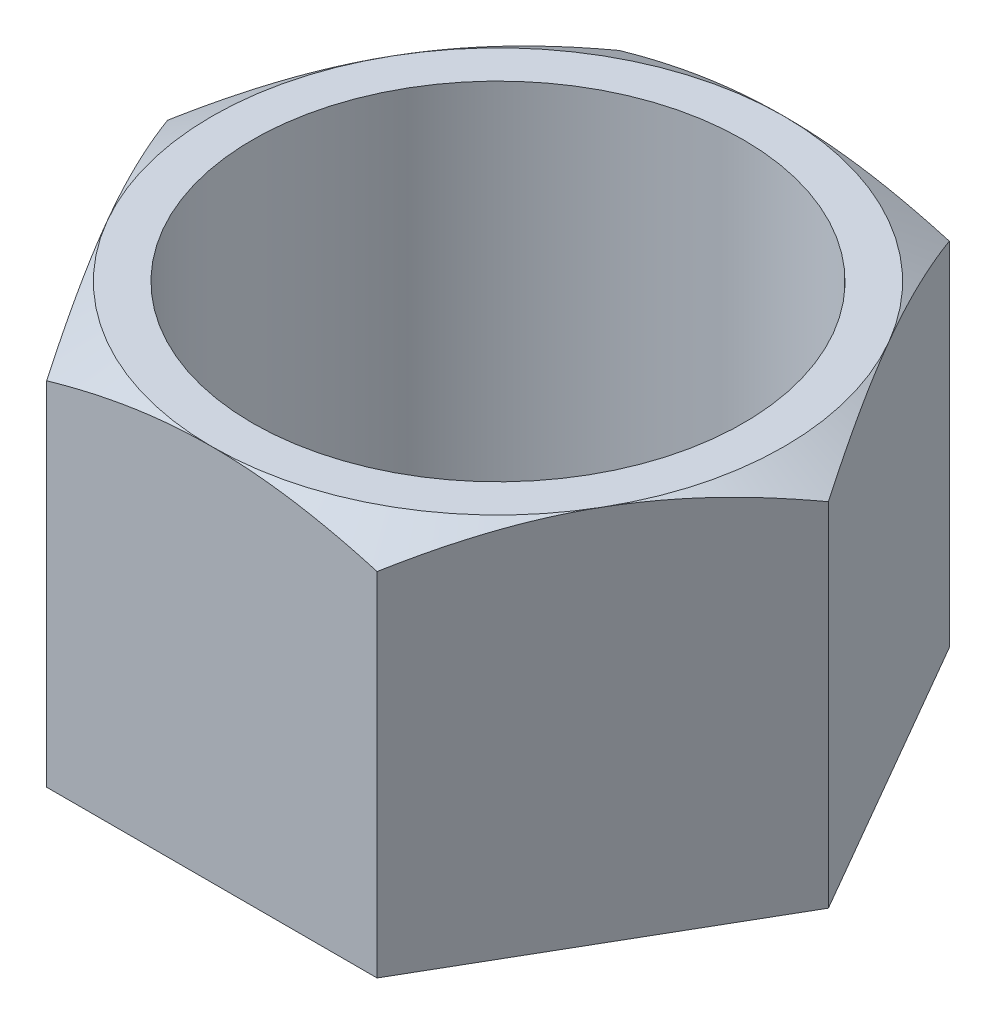
ISO-10303-21;
HEADER;
FILE_DESCRIPTION(('STEP AP214'),'2;1');
FILE_NAME('part.step','',(''),(''),'','','');
FILE_SCHEMA(('AUTOMOTIVE_DESIGN { 1 0 10303 214 1 1 1 1 }'));
ENDSEC;
DATA;
#1=APPLICATION_CONTEXT('core data for automotive mechanical design processes');
#2=APPLICATION_PROTOCOL_DEFINITION('international standard','automotive_design',2000,#1);
#3=PRODUCT_CONTEXT('',#1,'mechanical');
#4=PRODUCT('Part','Part','',(#3));
#5=PRODUCT_RELATED_PRODUCT_CATEGORY('part','',(#4));
#6=PRODUCT_DEFINITION_FORMATION('','',#4);
#7=PRODUCT_DEFINITION_CONTEXT('part definition',#1,'design');
#8=PRODUCT_DEFINITION('design','',#6,#7);
#9=PRODUCT_DEFINITION_SHAPE('','',#8);
#10=(LENGTH_UNIT() NAMED_UNIT(*) SI_UNIT(.MILLI.,.METRE.));
#11=(NAMED_UNIT(*) PLANE_ANGLE_UNIT() SI_UNIT($,.RADIAN.));
#12=(NAMED_UNIT(*) SI_UNIT($,.STERADIAN.) SOLID_ANGLE_UNIT());
#13=UNCERTAINTY_MEASURE_WITH_UNIT(LENGTH_MEASURE(1.E-05),#10,'distance_accuracy_value','');
#14=(GEOMETRIC_REPRESENTATION_CONTEXT(3) GLOBAL_UNCERTAINTY_ASSIGNED_CONTEXT((#13)) GLOBAL_UNIT_ASSIGNED_CONTEXT((#10,
#11,#12)) REPRESENTATION_CONTEXT('',''));
#15=CARTESIAN_POINT('',(0.,0.,0.));
#16=DIRECTION('',(0.,0.,1.));
#17=DIRECTION('',(1.,0.,0.));
#18=AXIS2_PLACEMENT_3D('',#15,#16,#17);
#19=CARTESIAN_POINT('',(8.75000000000018,20.,15.1554445662276));
#20=DIRECTION('',(-0.866025403784442,0.,-0.499999999999995));
#21=DIRECTION('',(-0.499999999999995,0.,0.866025403784442));
#22=AXIS2_PLACEMENT_3D('',#19,#20,#21);
#23=PLANE('',#22);
#24=CARTESIAN_POINT('',(8.74988452994634,18.6463036218551,15.1556445662276));
#25=CARTESIAN_POINT('',(8.94220608067119,18.7573332286213,14.8225338689817));
#26=CARTESIAN_POINT('',(9.13527778877703,18.8633245189489,14.4881238610383));
#27=CARTESIAN_POINT('',(9.52296941282811,19.0638299878254,13.8166222705129));
#28=CARTESIAN_POINT('',(9.71758981567844,19.1583403915805,13.4795298445866));
#29=CARTESIAN_POINT('',(10.1087549544331,19.3346136721167,12.8020119501137));
#30=CARTESIAN_POINT('',(10.3053031132929,19.4163463880283,12.4615805528344));
#31=CARTESIAN_POINT('',(10.6997652023538,19.5653092521169,11.7783521729212));
#32=CARTESIAN_POINT('',(10.8976790539741,19.6325402276478,11.4355553263932));
#33=CARTESIAN_POINT('',(11.2898012238542,19.7496400474975,10.7563798053868));
#34=CARTESIAN_POINT('',(11.4839804306472,19.7998964716164,10.4200515534478));
#35=CARTESIAN_POINT('',(11.8732286098864,19.884165362966,9.7458539302518));
#36=CARTESIAN_POINT('',(12.068297599386,19.9181775175294,9.40798452945743));
#37=CARTESIAN_POINT('',(12.4587632660955,19.9690990825114,8.73167815610525));
#38=CARTESIAN_POINT('',(12.6541592762256,19.9860288162489,8.3932423389638));
#39=CARTESIAN_POINT('',(13.0451316644246,20.0024214534515,7.71605829824646));
#40=CARTESIAN_POINT('',(13.2407080367337,20.0018848966266,7.3773100846471));
#41=CARTESIAN_POINT('',(13.6063365275202,19.9845650118537,6.74402296191016));
#42=CARTESIAN_POINT('',(13.7764147024639,19.9698942931565,6.44943892164917));
#43=CARTESIAN_POINT('',(14.1161798326727,19.927620397212,5.86094845348723));
#44=CARTESIAN_POINT('',(14.2858667594127,19.9000163052202,5.56704207499337));
#45=CARTESIAN_POINT('',(14.6247572252735,19.8323569553841,4.98006656992168));
#46=CARTESIAN_POINT('',(14.7939602482537,19.792291414023,4.68699833732578));
#47=CARTESIAN_POINT('',(15.1315730403667,19.7004121035848,4.10223582810077));
#48=CARTESIAN_POINT('',(15.2999827547779,19.6485975358418,3.81054164625241));
#49=CARTESIAN_POINT('',(15.811199777951,19.4742204932458,2.92508778842243));
#50=CARTESIAN_POINT('',(16.152526690289,19.3342708523476,2.33389223426252));
#51=CARTESIAN_POINT('',(16.8300909318384,19.0166424667218,1.16031654250711));
#52=CARTESIAN_POINT('',(17.1663369360539,18.8390383174895,0.577921379363705));
#53=CARTESIAN_POINT('',(17.5001154700538,18.6463036218551,-0.000200000000000166));
#54=B_SPLINE_CURVE_WITH_KNOTS('',3,(#24,#25,#26,#27,#28,#29,#30,#31,#32,#33,#34,#35,#36,#37,#38,
#39,#40,#41,#42,#43,#44,#45,#46,#47,#48,#49,#50,#51,#52,#53),.UNSPECIFIED.,.F.,.F.,(4,2,2,2,2,2,
2,2,2,2,2,2,2,2,4),(0.,1.20107305768067,2.40253995270546,3.60680134987754,4.81099402327995,
5.98546439607889,7.15995737398961,8.33305137922413,9.50610913577562,10.527280668868,
11.5485244377133,12.5706132099581,13.5927714817648,15.6820380431479,17.7672037024678),.UNSPECIFIED.);
#55=CARTESIAN_POINT('',(8.75000000000018,18.6463702891816,15.1554445662276));
#56=VERTEX_POINT('',#55);
#57=CARTESIAN_POINT('',(13.1250000000001,20.,7.57772228311379));
#58=VERTEX_POINT('',#57);
#59=EDGE_CURVE('E115',#56,#58,#54,.T.);
#60=ORIENTED_EDGE('',*,*,#59,.F.);
#61=DIRECTION('',(0.,-1.,0.));
#62=VECTOR('',#61,1.);
#63=CARTESIAN_POINT('',(8.75000000000018,20.,15.1554445662276));
#64=LINE('',#63,#62);
#65=CARTESIAN_POINT('',(8.75000000000018,0.,15.1554445662276));
#66=VERTEX_POINT('',#65);
#67=EDGE_CURVE('E64',#56,#66,#64,.T.);
#68=ORIENTED_EDGE('',*,*,#67,.T.);
#69=DIRECTION('',(0.499999999999995,0.,-0.866025403784442));
#70=VECTOR('',#69,1.);
#71=CARTESIAN_POINT('',(8.75000000000018,0.,15.1554445662276));
#72=LINE('',#71,#70);
#73=CARTESIAN_POINT('',(17.5,0.,0.));
#74=VERTEX_POINT('',#73);
#75=EDGE_CURVE('E122',#66,#74,#72,.T.);
#76=ORIENTED_EDGE('',*,*,#75,.T.);
#77=DIRECTION('',(0.,-1.,0.));
#78=VECTOR('',#77,1.);
#79=CARTESIAN_POINT('',(17.5,20.,0.));
#80=LINE('',#79,#78);
#81=CARTESIAN_POINT('',(17.5,18.6463702891816,0.));
#82=VERTEX_POINT('',#81);
#83=EDGE_CURVE('E136',#82,#74,#80,.T.);
#84=ORIENTED_EDGE('',*,*,#83,.F.);
#85=EDGE_CURVE('E123',#58,#82,#54,.T.);
#86=ORIENTED_EDGE('',*,*,#85,.F.);
#87=EDGE_LOOP('',(#60,#68,#76,#84,#86));
#88=FACE_BOUND('',#87,.T.);
#89=ADVANCED_FACE('F41',(#88),#23,.F.);
#90=CARTESIAN_POINT('',(17.5,20.,0.));
#91=DIRECTION('',(-0.866025403784438,0.,0.500000000000001));
#92=DIRECTION('',(0.500000000000001,0.,0.866025403784438));
#93=AXIS2_PLACEMENT_3D('',#90,#91,#92);
#94=PLANE('',#93);
#95=CARTESIAN_POINT('',(17.5001154700538,18.6463036218551,0.000200000000000298));
#96=CARTESIAN_POINT('',(17.307793919329,18.7573332286213,-0.332910697245878));
#97=CARTESIAN_POINT('',(17.1147222112231,18.8633245189489,-0.667320705189298));
#98=CARTESIAN_POINT('',(16.7270305871721,19.0638299878254,-1.33882229571467));
#99=CARTESIAN_POINT('',(16.5324101843217,19.1583403915805,-1.67591472164096));
#100=CARTESIAN_POINT('',(16.141245045567,19.3346136721167,-2.35343261611384));
#101=CARTESIAN_POINT('',(15.9446968867072,19.4163463880284,-2.69386401339313));
#102=CARTESIAN_POINT('',(15.5502347976464,19.5653092521169,-3.37709239330631));
#103=CARTESIAN_POINT('',(15.3523209460261,19.6325402276478,-3.71988923983432));
#104=CARTESIAN_POINT('',(14.960198776146,19.7496400474975,-4.39906476084074));
#105=CARTESIAN_POINT('',(14.7660195693529,19.7998964716164,-4.73539301277978));
#106=CARTESIAN_POINT('',(14.3767713901137,19.884165362966,-5.40959063597575));
#107=CARTESIAN_POINT('',(14.1817024006142,19.9181775175295,-5.74746003677012));
#108=CARTESIAN_POINT('',(13.7912367339046,19.9690990825115,-6.4237664101223));
#109=CARTESIAN_POINT('',(13.5958407237746,19.9860288162489,-6.76220222726374));
#110=CARTESIAN_POINT('',(13.2048683355755,20.0024214534515,-7.43938626798108));
#111=CARTESIAN_POINT('',(13.0092919632664,20.0018848966267,-7.77813448158044));
#112=CARTESIAN_POINT('',(12.6436634724799,19.9845650118538,-8.41142160431738));
#113=CARTESIAN_POINT('',(12.4735852975363,19.9698942931566,-8.70600564457838));
#114=CARTESIAN_POINT('',(12.1338201673274,19.927620397212,-9.29449611274033));
#115=CARTESIAN_POINT('',(11.9641332405874,19.9000163052203,-9.5884024912342));
#116=CARTESIAN_POINT('',(11.6252427747266,19.8323569553841,-10.1753779963059));
#117=CARTESIAN_POINT('',(11.4560397517464,19.7922914140231,-10.4684462289018));
#118=CARTESIAN_POINT('',(11.1184269596333,19.7004121035848,-11.0532087381268));
#119=CARTESIAN_POINT('',(10.9500172452221,19.6485975358418,-11.3449029199752));
#120=CARTESIAN_POINT('',(10.438800222049,19.4742204932458,-12.2303567778052));
#121=CARTESIAN_POINT('',(10.097473309711,19.3342708523477,-12.8215523319651));
#122=CARTESIAN_POINT('',(9.41990906816164,19.0166424667218,-13.9951280237206));
#123=CARTESIAN_POINT('',(9.08366306394605,18.8390383174895,-14.577523186864));
#124=CARTESIAN_POINT('',(8.74988452994613,18.6463036218551,-15.1556445662277));
#125=B_SPLINE_CURVE_WITH_KNOTS('',3,(#95,#96,#97,#98,#99,#100,#101,#102,#103,#104,#105,#106,
#107,#108,#109,#110,#111,#112,#113,#114,#115,#116,#117,#118,#119,#120,#121,#122,#123,#124),
.UNSPECIFIED.,.F.,.F.,(4,2,2,2,2,2,2,2,2,2,2,2,2,2,4),(0.,1.20107305768067,2.40253995270546,
3.60680134987754,4.81099402327995,5.98546439607889,7.15995737398961,8.33305137922413,
9.50610913577562,10.527280668868,11.5485244377134,12.5706132099582,13.5927714817649,
15.6820380431481,17.767203702468),.UNSPECIFIED.);
#126=CARTESIAN_POINT('',(13.125,20.,-7.57772228311388));
#127=VERTEX_POINT('',#126);
#128=EDGE_CURVE('E128',#82,#127,#125,.T.);
#129=ORIENTED_EDGE('',*,*,#128,.F.);
#130=ORIENTED_EDGE('',*,*,#83,.T.);
#131=DIRECTION('',(-0.500000000000001,0.,-0.866025403784438));
#132=VECTOR('',#131,1.);
#133=CARTESIAN_POINT('',(17.5,0.,0.));
#134=LINE('',#133,#132);
#135=CARTESIAN_POINT('',(8.74999999999997,0.,-15.1554445662277));
#136=VERTEX_POINT('',#135);
#137=EDGE_CURVE('E259',#74,#136,#134,.T.);
#138=ORIENTED_EDGE('',*,*,#137,.T.);
#139=DIRECTION('',(0.,-1.,0.));
#140=VECTOR('',#139,1.);
#141=CARTESIAN_POINT('',(8.74999999999997,20.,-15.1554445662277));
#142=LINE('',#141,#140);
#143=CARTESIAN_POINT('',(8.74999999999997,18.6463702891816,-15.1554445662277));
#144=VERTEX_POINT('',#143);
#145=EDGE_CURVE('E207',#144,#136,#142,.T.);
#146=ORIENTED_EDGE('',*,*,#145,.F.);
#147=EDGE_CURVE('E137',#127,#144,#125,.T.);
#148=ORIENTED_EDGE('',*,*,#147,.F.);
#149=EDGE_LOOP('',(#129,#130,#138,#146,#148));
#150=FACE_BOUND('',#149,.T.);
#151=ADVANCED_FACE('F195',(#150),#94,.F.);
#152=CARTESIAN_POINT('',(8.74999999999997,20.,-15.1554445662277));
#153=DIRECTION('',(0.,0.,1.));
#154=DIRECTION('',(1.,0.,0.));
#155=AXIS2_PLACEMENT_3D('',#152,#153,#154);
#156=PLANE('',#155);
#157=CARTESIAN_POINT('',(33.4754355047652,7.53450030257999,-15.1554445662278));
#158=CARTESIAN_POINT('',(32.7085164534544,7.93782189366615,-15.1554445662278));
#159=CARTESIAN_POINT('',(31.9406572896009,8.33936885702415,-15.1554445662278));
#160=CARTESIAN_POINT('',(30.4025919359014,9.13800952363892,-15.1554445662278));
#161=CARTESIAN_POINT('',(29.6323856610771,9.53510306316187,-15.1554445662278));
#162=CARTESIAN_POINT('',(28.0881872828031,10.3244287253741,-15.1554445662278));
#163=CARTESIAN_POINT('',(27.3141915022601,10.7166536650912,-15.1554445662278));
#164=CARTESIAN_POINT('',(25.7628610719403,11.4944268749106,-15.1554445662278));
#165=CARTESIAN_POINT('',(24.9855264658287,11.8799752319994,-15.1554445662278));
#166=CARTESIAN_POINT('',(23.3819645476763,12.6646832913896,-15.1554445662278));
#167=CARTESIAN_POINT('',(22.5554958456296,13.0633510193118,-15.1554445662277));
#168=CARTESIAN_POINT('',(20.8968604608328,13.8487577567814,-15.1554445662277));
#169=CARTESIAN_POINT('',(20.0646935733522,14.2354963349486,-15.1554445662277));
#170=CARTESIAN_POINT('',(18.3936628844106,14.9932274176335,-15.1554445662277));
#171=CARTESIAN_POINT('',(17.5548025421458,15.364227499657,-15.1554445662277));
#172=CARTESIAN_POINT('',(16.2898916539533,15.9051786950646,-15.1554445662277));
#173=CARTESIAN_POINT('',(15.8671622754374,16.0828998923224,-15.1554445662277));
#174=CARTESIAN_POINT('',(15.019222508146,16.4323129696105,-15.1554445662277));
#175=CARTESIAN_POINT('',(14.5940121628569,16.6040049549525,-15.1554445662277));
#176=CARTESIAN_POINT('',(13.6978122220743,16.9573489028654,-15.1554445662277));
#177=CARTESIAN_POINT('',(13.2265293957891,17.1382597700732,-15.1554445662277));
#178=CARTESIAN_POINT('',(12.2802392890441,17.4900310040304,-15.1554445662277));
#179=CARTESIAN_POINT('',(11.8052321480463,17.6608917451028,-15.1554445662277));
#180=CARTESIAN_POINT('',(10.8509440856924,17.9907496474135,-15.1554445662277));
#181=CARTESIAN_POINT('',(10.3716620865205,18.1497437163009,-15.1554445662277));
#182=CARTESIAN_POINT('',(9.40867280572553,18.4535926867794,-15.1554445662277));
#183=CARTESIAN_POINT('',(8.92496552324996,18.5984475856467,-15.1554445662277));
#184=CARTESIAN_POINT('',(7.48716586653893,19.0022831661275,-15.1554445662277));
#185=CARTESIAN_POINT('',(6.52610906980685,19.2377484999723,-15.1554445662277));
#186=CARTESIAN_POINT('',(5.07204533995559,19.5267270407932,-15.1554445662277));
#187=CARTESIAN_POINT('',(4.58534073977665,19.6123431301753,-15.1554445662277));
#188=CARTESIAN_POINT('',(3.60825639768221,19.7595476280251,-15.1554445662277));
#189=CARTESIAN_POINT('',(3.11787670535746,19.8211363601189,-15.1554445662277));
#190=CARTESIAN_POINT('',(2.12428194090053,19.9190763740208,-15.1554445662277));
#191=CARTESIAN_POINT('',(1.6210119255986,19.9548765314852,-15.1554445662277));
#192=CARTESIAN_POINT('',(0.613238559986097,19.9976462022484,-15.1554445662277));
#193=CARTESIAN_POINT('',(0.108735227753677,20.0046161356399,-15.1554445662277));
#194=CARTESIAN_POINT('',(-0.899805773503052,19.9894249494338,-15.1554445662277));
#195=CARTESIAN_POINT('',(-1.40384346098623,19.9672650389502,-15.1554445662277));
#196=CARTESIAN_POINT('',(-2.4098748394523,19.8947603298869,-15.1554445662277));
#197=CARTESIAN_POINT('',(-2.91186847131162,19.8444147217978,-15.1554445662277));
#198=CARTESIAN_POINT('',(-3.9235743042002,19.7161208086671,-15.1554445662277));
#199=CARTESIAN_POINT('',(-4.4332113370169,19.6375860752743,-15.1554445662277));
#200=CARTESIAN_POINT('',(-5.4481070707292,19.4559797830248,-15.1554445662277));
#201=CARTESIAN_POINT('',(-5.95336525300239,19.3529053578081,-15.1554445662276));
#202=CARTESIAN_POINT('',(-6.95927382659931,19.1252979532279,-15.1554445662276));
#203=CARTESIAN_POINT('',(-7.45992153005125,19.0007531997553,-15.1554445662276));
#204=CARTESIAN_POINT('',(-8.45625570245552,18.7333274971175,-15.1554445662276));
#205=CARTESIAN_POINT('',(-8.95194218424121,18.5904465953963,-15.1554445662276));
#206=CARTESIAN_POINT('',(-9.99019305341515,18.273399453593,-15.1554445662276));
#207=CARTESIAN_POINT('',(-10.5322328988061,18.0975239383735,-15.1554445662276));
#208=CARTESIAN_POINT('',(-11.6110011855649,17.7301218154631,-15.1554445662276));
#209=CARTESIAN_POINT('',(-12.1477291500434,17.5385938165622,-15.1554445662276));
#210=CARTESIAN_POINT('',(-13.2165931490162,17.1425627590696,-15.1554445662276));
#211=CARTESIAN_POINT('',(-13.7487273185249,16.938054688546,-15.1554445662276));
#212=CARTESIAN_POINT('',(-14.8087428824185,16.5183799610651,-15.1554445662276));
#213=CARTESIAN_POINT('',(-15.336624398692,16.3032136108656,-15.1554445662276));
#214=CARTESIAN_POINT('',(-16.3896296323411,15.8636381803235,-15.1554445662276));
#215=CARTESIAN_POINT('',(-16.9147466837913,15.6392131755685,-15.1554445662276));
#216=CARTESIAN_POINT('',(-17.9617490928508,15.1829560926661,-15.1554445662276));
#217=CARTESIAN_POINT('',(-18.4836344329743,14.9511239744831,-15.1554445662276));
#218=CARTESIAN_POINT('',(-19.5244843588656,14.4812963051241,-15.1554445662276));
#219=CARTESIAN_POINT('',(-20.0434495451039,14.2433020819825,-15.1554445662276));
#220=CARTESIAN_POINT('',(-21.0789338043124,13.7620633080001,-15.1554445662276));
#221=CARTESIAN_POINT('',(-21.5954528843639,13.5188187723696,-15.1554445662276));
#222=CARTESIAN_POINT('',(-23.0712473228751,12.8160298299479,-15.1554445662276));
#223=CARTESIAN_POINT('',(-24.027906863294,12.3509919099315,-15.1554445662276));
#224=CARTESIAN_POINT('',(-25.9355526521193,11.40933170952,-15.1554445662276));
#225=CARTESIAN_POINT('',(-26.8865385675975,10.9327087574826,-15.1554445662276));
#226=CARTESIAN_POINT('',(-28.7792370969611,9.97299034403316,-15.1554445662276));
#227=CARTESIAN_POINT('',(-29.7209722978866,9.489939373715,-15.1554445662276));
#228=CARTESIAN_POINT('',(-31.1308417613524,8.76022208834859,-15.1554445662276));
#229=CARTESIAN_POINT('',(-31.6003169157204,8.51613977052755,-15.1554445662276));
#230=CARTESIAN_POINT('',(-32.5384594847679,8.02643258339529,-15.1554445662276));
#231=CARTESIAN_POINT('',(-33.0071269030326,7.7808077209535,-15.1554445662276));
#232=CARTESIAN_POINT('',(-33.4754355047653,7.53450030257999,-15.1554445662276));
#233=B_SPLINE_CURVE_WITH_KNOTS('',3,(#157,#158,#159,#160,#161,#162,#163,#164,#165,#166,#167,
#168,#169,#170,#171,#172,#173,#174,#175,#176,#177,#178,#179,#180,#181,#182,#183,#184,#185,#186,
#187,#188,#189,#190,#191,#192,#193,#194,#195,#196,#197,#198,#199,#200,#201,#202,#203,#204,#205,
#206,#207,#208,#209,#210,#211,#212,#213,#214,#215,#216,#217,#218,#219,#220,#221,#222,#223,#224,
#225,#226,#227,#228,#229,#230,#231,#232),.UNSPECIFIED.,.F.,.F.,(4,2,2,2,2,2,2,2,2,2,2,2,2,2,2,2,
2,2,2,2,2,2,2,2,2,2,2,2,2,2,2,2,2,2,2,2,2,4),(0.,2.59952552549204,5.1991463134323,
7.80223112784135,10.4052820021831,13.1580004630053,15.9108183508064,18.6622954567994,
20.0379631033629,21.4136067093108,22.9279464680161,24.4422297884726,25.9569063500141,
27.4715832033393,30.4364416810586,31.9184917490478,33.4005218545075,34.9133536422533,
36.4261633860548,37.9389103385268,39.4517007401953,40.9979833096202,42.5444465813396,
44.0917606313234,45.6390706777807,47.3483541479036,49.0577897065801,50.7678893848166,
52.4779398729261,54.1910653496653,55.9042000874395,57.6169686403318,59.3297322318828,
62.5207141807863,65.7118815702586,68.8870326989313,70.4744334475427,72.0618271319707),.UNSPECIFIED.);
#234=CARTESIAN_POINT('',(0.,20.,-15.1554445662277));
#235=VERTEX_POINT('',#234);
#236=EDGE_CURVE('E189',#144,#235,#233,.T.);
#237=ORIENTED_EDGE('',*,*,#236,.F.);
#238=ORIENTED_EDGE('',*,*,#145,.T.);
#239=DIRECTION('',(-1.,0.,0.));
#240=VECTOR('',#239,1.);
#241=CARTESIAN_POINT('',(8.74999999999997,0.,-15.1554445662277));
#242=LINE('',#241,#240);
#243=CARTESIAN_POINT('',(-8.75000000000007,0.,-15.1554445662276));
#244=VERTEX_POINT('',#243);
#245=EDGE_CURVE('E225',#136,#244,#242,.T.);
#246=ORIENTED_EDGE('',*,*,#245,.T.);
#247=DIRECTION('',(0.,-1.,0.));
#248=VECTOR('',#247,1.);
#249=CARTESIAN_POINT('',(-8.75000000000007,20.,-15.1554445662276));
#250=LINE('',#249,#248);
#251=CARTESIAN_POINT('',(-8.75000000000007,18.6463702891816,-15.1554445662276));
#252=VERTEX_POINT('',#251);
#253=EDGE_CURVE('E223',#252,#244,#250,.T.);
#254=ORIENTED_EDGE('',*,*,#253,.F.);
#255=EDGE_CURVE('E183',#235,#252,#233,.T.);
#256=ORIENTED_EDGE('',*,*,#255,.F.);
#257=EDGE_LOOP('',(#237,#238,#246,#254,#256));
#258=FACE_BOUND('',#257,.T.);
#259=ADVANCED_FACE('F191',(#258),#156,.F.);
#260=CARTESIAN_POINT('',(-8.75000000000007,20.,-15.1554445662276));
#261=DIRECTION('',(0.866025403784442,0.,0.499999999999995));
#262=DIRECTION('',(0.499999999999995,0.,-0.866025403784442));
#263=AXIS2_PLACEMENT_3D('',#260,#261,#262);
#264=PLANE('',#263);
#265=CARTESIAN_POINT('',(-8.74988452994623,18.6463036218551,-15.1556445662276));
#266=CARTESIAN_POINT('',(-8.94220608067108,18.7573332286213,-14.8225338689818));
#267=CARTESIAN_POINT('',(-9.13527778877692,18.8633245189489,-14.4881238610383));
#268=CARTESIAN_POINT('',(-9.522969412828,19.0638299878254,-13.816622270513));
#269=CARTESIAN_POINT('',(-9.71758981567833,19.1583403915805,-13.4795298445867));
#270=CARTESIAN_POINT('',(-10.108754954433,19.3346136721167,-12.8020119501138));
#271=CARTESIAN_POINT('',(-10.3053031132928,19.4163463880284,-12.4615805528345));
#272=CARTESIAN_POINT('',(-10.6997652023537,19.5653092521169,-11.7783521729213));
#273=CARTESIAN_POINT('',(-10.897679053974,19.6325402276478,-11.4355553263933));
#274=CARTESIAN_POINT('',(-11.289801223854,19.7496400474975,-10.7563798053869));
#275=CARTESIAN_POINT('',(-11.4839804306471,19.7998964716164,-10.4200515534478));
#276=CARTESIAN_POINT('',(-11.8732286098863,19.884165362966,-9.74585393025186));
#277=CARTESIAN_POINT('',(-12.0682975993859,19.9181775175295,-9.4079845294575));
#278=CARTESIAN_POINT('',(-12.4587632660954,19.9690990825115,-8.73167815610531));
#279=CARTESIAN_POINT('',(-12.6541592762254,19.9860288162489,-8.39324233896387));
#280=CARTESIAN_POINT('',(-13.0451316644245,20.0024214534515,-7.71605829824653));
#281=CARTESIAN_POINT('',(-13.2407080367336,20.0018848966267,-7.37731008464717));
#282=CARTESIAN_POINT('',(-13.6063365275201,19.9845650118538,-6.74402296191022));
#283=CARTESIAN_POINT('',(-13.7764147024638,19.9698942931566,-6.44943892164922));
#284=CARTESIAN_POINT('',(-14.1161798326726,19.927620397212,-5.86094845348727));
#285=CARTESIAN_POINT('',(-14.2858667594126,19.9000163052203,-5.5670420749934));
#286=CARTESIAN_POINT('',(-14.6247572252734,19.8323569553841,-4.9800665699217));
#287=CARTESIAN_POINT('',(-14.7939602482536,19.7922914140231,-4.68699833732578));
#288=CARTESIAN_POINT('',(-15.1315730403667,19.7004121035848,-4.10223582810076));
#289=CARTESIAN_POINT('',(-15.2999827547779,19.6485975358419,-3.81054164625239));
#290=CARTESIAN_POINT('',(-15.811199777951,19.4742204932458,-2.92508778842239));
#291=CARTESIAN_POINT('',(-16.1525266902889,19.3342708523477,-2.33389223426247));
#292=CARTESIAN_POINT('',(-16.8300909318383,19.0166424667218,-1.16031654250702));
#293=CARTESIAN_POINT('',(-17.1663369360539,18.8390383174895,-0.577921379363599));
#294=CARTESIAN_POINT('',(-17.5001154700538,18.6463036218551,0.000200000000120672));
#295=B_SPLINE_CURVE_WITH_KNOTS('',3,(#265,#266,#267,#268,#269,#270,#271,#272,#273,#274,#275,
#276,#277,#278,#279,#280,#281,#282,#283,#284,#285,#286,#287,#288,#289,#290,#291,#292,#293,#294),
.UNSPECIFIED.,.F.,.F.,(4,2,2,2,2,2,2,2,2,2,2,2,2,2,4),(0.,1.20107305768066,2.40253995270546,
3.60680134987754,4.81099402327995,5.98546439607889,7.15995737398961,8.33305137922412,
9.50610913577561,10.527280668868,11.5485244377134,12.5706132099582,13.5927714817649,
15.6820380431481,17.767203702468),.UNSPECIFIED.);
#296=CARTESIAN_POINT('',(-13.1250000000001,20.,-7.57772228311379));
#297=VERTEX_POINT('',#296);
#298=EDGE_CURVE('E190',#252,#297,#295,.T.);
#299=ORIENTED_EDGE('',*,*,#298,.F.);
#300=ORIENTED_EDGE('',*,*,#253,.T.);
#301=DIRECTION('',(-0.499999999999995,0.,0.866025403784442));
#302=VECTOR('',#301,1.);
#303=CARTESIAN_POINT('',(-8.75000000000007,0.,-15.1554445662276));
#304=LINE('',#303,#302);
#305=CARTESIAN_POINT('',(-17.5,0.,1.2220184685951E-13));
#306=VERTEX_POINT('',#305);
#307=EDGE_CURVE('E257',#244,#306,#304,.T.);
#308=ORIENTED_EDGE('',*,*,#307,.T.);
#309=DIRECTION('',(0.,-1.,0.));
#310=VECTOR('',#309,1.);
#311=CARTESIAN_POINT('',(-17.5,20.,1.2220184685951E-13));
#312=LINE('',#311,#310);
#313=CARTESIAN_POINT('',(-17.5,18.6463702891816,1.22597411139621E-13));
#314=VERTEX_POINT('',#313);
#315=EDGE_CURVE('E229',#314,#306,#312,.T.);
#316=ORIENTED_EDGE('',*,*,#315,.F.);
#317=EDGE_CURVE('E177',#297,#314,#295,.T.);
#318=ORIENTED_EDGE('',*,*,#317,.F.);
#319=EDGE_LOOP('',(#299,#300,#308,#316,#318));
#320=FACE_BOUND('',#319,.T.);
#321=ADVANCED_FACE('F194',(#320),#264,.F.);
#322=CARTESIAN_POINT('',(-17.5,20.,1.2220184685951E-13));
#323=DIRECTION('',(0.866025403784435,0.,-0.500000000000007));
#324=DIRECTION('',(-0.500000000000007,0.,-0.866025403784435));
#325=AXIS2_PLACEMENT_3D('',#322,#323,#324);
#326=PLANE('',#325);
#327=CARTESIAN_POINT('',(-17.5001154700538,18.6463036218551,-0.000199999999877798));
#328=CARTESIAN_POINT('',(-17.307793919329,18.7573332286213,0.332910697246));
#329=CARTESIAN_POINT('',(-17.1147222112231,18.8633245189489,0.667320705189418));
#330=CARTESIAN_POINT('',(-16.727030587172,19.0638299878254,1.33882229571479));
#331=CARTESIAN_POINT('',(-16.5324101843217,19.1583403915805,1.67591472164108));
#332=CARTESIAN_POINT('',(-16.141245045567,19.3346136721167,2.35343261611395));
#333=CARTESIAN_POINT('',(-15.9446968867072,19.4163463880284,2.69386401339324));
#334=CARTESIAN_POINT('',(-15.5502347976463,19.5653092521169,3.37709239330642));
#335=CARTESIAN_POINT('',(-15.352320946026,19.6325402276478,3.71988923983443));
#336=CARTESIAN_POINT('',(-14.960198776146,19.7496400474975,4.39906476084084));
#337=CARTESIAN_POINT('',(-14.7660195693529,19.7998964716164,4.73539301277989));
#338=CARTESIAN_POINT('',(-14.3767713901137,19.884165362966,5.40959063597586));
#339=CARTESIAN_POINT('',(-14.1817024006141,19.9181775175295,5.74746003677022));
#340=CARTESIAN_POINT('',(-13.7912367339046,19.9690990825115,6.4237664101224));
#341=CARTESIAN_POINT('',(-13.5958407237745,19.9860288162489,6.76220222726384));
#342=CARTESIAN_POINT('',(-13.2048683355755,20.0024214534515,7.43938626798117));
#343=CARTESIAN_POINT('',(-13.0092919632664,20.0018848966267,7.77813448158053));
#344=CARTESIAN_POINT('',(-12.6436634724799,19.9845650118538,8.41142160431747));
#345=CARTESIAN_POINT('',(-12.4735852975362,19.9698942931566,8.70600564457847));
#346=CARTESIAN_POINT('',(-12.1338201673274,19.927620397212,9.29449611274042));
#347=CARTESIAN_POINT('',(-11.9641332405874,19.9000163052203,9.58840249123429));
#348=CARTESIAN_POINT('',(-11.6252427747265,19.8323569553841,10.175377996306));
#349=CARTESIAN_POINT('',(-11.4560397517463,19.7922914140231,10.4684462289019));
#350=CARTESIAN_POINT('',(-11.1184269596333,19.7004121035848,11.0532087381269));
#351=CARTESIAN_POINT('',(-10.950017245222,19.6485975358418,11.3449029199753));
#352=CARTESIAN_POINT('',(-10.4388002220489,19.4742204932458,12.2303567778053));
#353=CARTESIAN_POINT('',(-10.097473309711,19.3342708523477,12.8215523319652));
#354=CARTESIAN_POINT('',(-9.41990906816154,19.0166424667218,13.9951280237206));
#355=CARTESIAN_POINT('',(-9.08366306394595,18.8390383174895,14.577523186864));
#356=CARTESIAN_POINT('',(-8.74988452994602,18.6463036218551,15.1556445662278));
#357=B_SPLINE_CURVE_WITH_KNOTS('',3,(#327,#328,#329,#330,#331,#332,#333,#334,#335,#336,#337,
#338,#339,#340,#341,#342,#343,#344,#345,#346,#347,#348,#349,#350,#351,#352,#353,#354,#355,#356),
.UNSPECIFIED.,.F.,.F.,(4,2,2,2,2,2,2,2,2,2,2,2,2,2,4),(0.,1.20107305768067,2.40253995270546,
3.60680134987754,4.81099402327995,5.98546439607889,7.15995737398961,8.33305137922413,
9.50610913577562,10.527280668868,11.5485244377134,12.5706132099582,13.5927714817649,
15.6820380431481,17.767203702468),.UNSPECIFIED.);
#358=CARTESIAN_POINT('',(-13.125,20.,7.57772228311397));
#359=VERTEX_POINT('',#358);
#360=EDGE_CURVE('E241',#314,#359,#357,.T.);
#361=ORIENTED_EDGE('',*,*,#360,.F.);
#362=ORIENTED_EDGE('',*,*,#315,.T.);
#363=DIRECTION('',(0.500000000000007,0.,0.866025403784435));
#364=VECTOR('',#363,1.);
#365=CARTESIAN_POINT('',(-17.5,0.,1.2220184685951E-13));
#366=LINE('',#365,#364);
#367=CARTESIAN_POINT('',(-8.74999999999986,0.,15.1554445662278));
#368=VERTEX_POINT('',#367);
#369=EDGE_CURVE('E253',#306,#368,#366,.T.);
#370=ORIENTED_EDGE('',*,*,#369,.T.);
#371=DIRECTION('',(0.,-1.,0.));
#372=VECTOR('',#371,1.);
#373=CARTESIAN_POINT('',(-8.74999999999986,20.,15.1554445662278));
#374=LINE('',#373,#372);
#375=CARTESIAN_POINT('',(-8.74999999999986,18.6463702891816,15.1554445662278));
#376=VERTEX_POINT('',#375);
#377=EDGE_CURVE('E232',#376,#368,#374,.T.);
#378=ORIENTED_EDGE('',*,*,#377,.F.);
#379=EDGE_CURVE('E170',#359,#376,#357,.T.);
#380=ORIENTED_EDGE('',*,*,#379,.F.);
#381=EDGE_LOOP('',(#361,#362,#370,#378,#380));
#382=FACE_BOUND('',#381,.T.);
#383=ADVANCED_FACE('F240',(#382),#326,.F.);
#384=CARTESIAN_POINT('',(-8.74999999999986,20.,15.1554445662278));
#385=DIRECTION('',(0.,0.,-1.));
#386=DIRECTION('',(-1.,0.,0.));
#387=AXIS2_PLACEMENT_3D('',#384,#385,#386);
#388=PLANE('',#387);
#389=CARTESIAN_POINT('',(-33.4754355047651,7.53450030257999,15.155444566228));
#390=CARTESIAN_POINT('',(-32.7085164534543,7.93782189366616,15.155444566228));
#391=CARTESIAN_POINT('',(-31.9406572896008,8.33936885702415,15.155444566228));
#392=CARTESIAN_POINT('',(-30.4025919359013,9.13800952363892,15.155444566228));
#393=CARTESIAN_POINT('',(-29.632385661077,9.53510306316188,15.155444566228));
#394=CARTESIAN_POINT('',(-28.088187282803,10.3244287253741,15.155444566228));
#395=CARTESIAN_POINT('',(-27.31419150226,10.7166536650912,15.155444566228));
#396=CARTESIAN_POINT('',(-25.7628610719402,11.4944268749106,15.1554445662279));
#397=CARTESIAN_POINT('',(-24.9855264658286,11.8799752319994,15.1554445662279));
#398=CARTESIAN_POINT('',(-23.3819645476762,12.6646832913896,15.1554445662279));
#399=CARTESIAN_POINT('',(-22.5554958456295,13.0633510193118,15.1554445662279));
#400=CARTESIAN_POINT('',(-20.8968604608327,13.8487577567814,15.1554445662279));
#401=CARTESIAN_POINT('',(-20.0646935733521,14.2354963349486,15.1554445662279));
#402=CARTESIAN_POINT('',(-18.3936628844105,14.9932274176335,15.1554445662279));
#403=CARTESIAN_POINT('',(-17.5548025421457,15.364227499657,15.1554445662279));
#404=CARTESIAN_POINT('',(-16.2898916539532,15.9051786950646,15.1554445662278));
#405=CARTESIAN_POINT('',(-15.8671622754373,16.0828998923224,15.1554445662278));
#406=CARTESIAN_POINT('',(-15.0192225081459,16.4323129696105,15.1554445662278));
#407=CARTESIAN_POINT('',(-14.5940121628568,16.6040049549525,15.1554445662278));
#408=CARTESIAN_POINT('',(-13.6978122220742,16.9573489028654,15.1554445662278));
#409=CARTESIAN_POINT('',(-13.226529395789,17.1382597700732,15.1554445662278));
#410=CARTESIAN_POINT('',(-12.2802392890439,17.4900310040304,15.1554445662278));
#411=CARTESIAN_POINT('',(-11.8052321480462,17.6608917451028,15.1554445662278));
#412=CARTESIAN_POINT('',(-10.8509440856923,17.9907496474135,15.1554445662278));
#413=CARTESIAN_POINT('',(-10.3716620865204,18.1497437163009,15.1554445662278));
#414=CARTESIAN_POINT('',(-9.40867280572541,18.4535926867794,15.1554445662278));
#415=CARTESIAN_POINT('',(-8.92496552324984,18.5984475856467,15.1554445662278));
#416=CARTESIAN_POINT('',(-7.48716586653881,19.0022831661275,15.1554445662277));
#417=CARTESIAN_POINT('',(-6.52610906980673,19.2377484999723,15.1554445662277));
#418=CARTESIAN_POINT('',(-5.07204533995547,19.5267270407932,15.1554445662277));
#419=CARTESIAN_POINT('',(-4.58534073977653,19.6123431301753,15.1554445662277));
#420=CARTESIAN_POINT('',(-3.60825639768209,19.7595476280251,15.1554445662277));
#421=CARTESIAN_POINT('',(-3.11787670535735,19.8211363601189,15.1554445662277));
#422=CARTESIAN_POINT('',(-2.12428194090041,19.9190763740208,15.1554445662277));
#423=CARTESIAN_POINT('',(-1.62101192559849,19.9548765314852,15.1554445662277));
#424=CARTESIAN_POINT('',(-0.613238559985983,19.9976462022484,15.1554445662277));
#425=CARTESIAN_POINT('',(-0.108735227753566,20.0046161356399,15.1554445662277));
#426=CARTESIAN_POINT('',(0.899805773503162,19.9894249494338,15.1554445662277));
#427=CARTESIAN_POINT('',(1.40384346098634,19.9672650389502,15.1554445662277));
#428=CARTESIAN_POINT('',(2.40987483945242,19.8947603298869,15.1554445662276));
#429=CARTESIAN_POINT('',(2.91186847131174,19.8444147217978,15.1554445662276));
#430=CARTESIAN_POINT('',(3.92357430420031,19.7161208086671,15.1554445662276));
#431=CARTESIAN_POINT('',(4.43321133701702,19.6375860752743,15.1554445662276));
#432=CARTESIAN_POINT('',(5.44810707072932,19.4559797830248,15.1554445662276));
#433=CARTESIAN_POINT('',(5.95336525300251,19.3529053578081,15.1554445662276));
#434=CARTESIAN_POINT('',(6.95927382659942,19.1252979532279,15.1554445662276));
#435=CARTESIAN_POINT('',(7.45992153005137,19.0007531997553,15.1554445662276));
#436=CARTESIAN_POINT('',(8.45625570245563,18.7333274971175,15.1554445662276));
#437=CARTESIAN_POINT('',(8.95194218424132,18.5904465953963,15.1554445662276));
#438=CARTESIAN_POINT('',(9.99019305341525,18.273399453593,15.1554445662276));
#439=CARTESIAN_POINT('',(10.5322328988062,18.0975239383735,15.1554445662276));
#440=CARTESIAN_POINT('',(11.611001185565,17.7301218154631,15.1554445662275));
#441=CARTESIAN_POINT('',(12.1477291500435,17.5385938165622,15.1554445662275));
#442=CARTESIAN_POINT('',(13.2165931490163,17.1425627590696,15.1554445662275));
#443=CARTESIAN_POINT('',(13.748727318525,16.938054688546,15.1554445662275));
#444=CARTESIAN_POINT('',(14.8087428824186,16.5183799610651,15.1554445662275));
#445=CARTESIAN_POINT('',(15.3366243986921,16.3032136108656,15.1554445662275));
#446=CARTESIAN_POINT('',(16.3896296323412,15.8636381803235,15.1554445662275));
#447=CARTESIAN_POINT('',(16.9147466837914,15.6392131755685,15.1554445662275));
#448=CARTESIAN_POINT('',(17.9617490928509,15.1829560926661,15.1554445662275));
#449=CARTESIAN_POINT('',(18.4836344329744,14.9511239744831,15.1554445662275));
#450=CARTESIAN_POINT('',(19.5244843588657,14.4812963051241,15.1554445662275));
#451=CARTESIAN_POINT('',(20.043449545104,14.2433020819825,15.1554445662275));
#452=CARTESIAN_POINT('',(21.0789338043125,13.7620633080001,15.1554445662274));
#453=CARTESIAN_POINT('',(21.595452884364,13.5188187723696,15.1554445662274));
#454=CARTESIAN_POINT('',(23.0712473228752,12.8160298299479,15.1554445662274));
#455=CARTESIAN_POINT('',(24.0279068632941,12.3509919099315,15.1554445662274));
#456=CARTESIAN_POINT('',(25.9355526521194,11.40933170952,15.1554445662274));
#457=CARTESIAN_POINT('',(26.8865385675976,10.9327087574826,15.1554445662274));
#458=CARTESIAN_POINT('',(28.7792370969612,9.97299034403317,15.1554445662274));
#459=CARTESIAN_POINT('',(29.7209722978867,9.48993937371501,15.1554445662274));
#460=CARTESIAN_POINT('',(31.1308417613525,8.76022208834858,15.1554445662273));
#461=CARTESIAN_POINT('',(31.6003169157205,8.51613977052754,15.1554445662273));
#462=CARTESIAN_POINT('',(32.538459484768,8.02643258339528,15.1554445662273));
#463=CARTESIAN_POINT('',(33.0071269030327,7.78080772095349,15.1554445662273));
#464=CARTESIAN_POINT('',(33.4754355047654,7.53450030257999,15.1554445662273));
#465=B_SPLINE_CURVE_WITH_KNOTS('',3,(#389,#390,#391,#392,#393,#394,#395,#396,#397,#398,#399,
#400,#401,#402,#403,#404,#405,#406,#407,#408,#409,#410,#411,#412,#413,#414,#415,#416,#417,#418,
#419,#420,#421,#422,#423,#424,#425,#426,#427,#428,#429,#430,#431,#432,#433,#434,#435,#436,#437,
#438,#439,#440,#441,#442,#443,#444,#445,#446,#447,#448,#449,#450,#451,#452,#453,#454,#455,#456,
#457,#458,#459,#460,#461,#462,#463,#464),.UNSPECIFIED.,.F.,.F.,(4,2,2,2,2,2,2,2,2,2,2,2,2,2,2,2,
2,2,2,2,2,2,2,2,2,2,2,2,2,2,2,2,2,2,2,2,2,4),(0.,2.59952552549204,5.19914631343231,
7.80223112784135,10.4052820021831,13.1580004630053,15.9108183508064,18.6622954567994,
20.0379631033629,21.4136067093108,22.9279464680162,24.4422297884727,25.9569063500141,
27.4715832033393,30.4364416810586,31.9184917490478,33.4005218545076,34.9133536422533,
36.4261633860548,37.9389103385268,39.4517007401953,40.9979833096202,42.5444465813396,
44.0917606313234,45.6390706777807,47.3483541479036,49.0577897065801,50.7678893848166,
52.4779398729261,54.1910653496652,55.9042000874395,57.6169686403318,59.3297322318828,
62.5207141807863,65.7118815702586,68.8870326989313,70.4744334475427,72.0618271319707),.UNSPECIFIED.);
#466=CARTESIAN_POINT('',(1.59245347466138E-13,20.,15.1554445662277));
#467=VERTEX_POINT('',#466);
#468=EDGE_CURVE('E246',#376,#467,#465,.T.);
#469=ORIENTED_EDGE('',*,*,#468,.F.);
#470=ORIENTED_EDGE('',*,*,#377,.T.);
#471=DIRECTION('',(1.,0.,0.));
#472=VECTOR('',#471,1.);
#473=CARTESIAN_POINT('',(-8.74999999999986,0.,15.1554445662278));
#474=LINE('',#473,#472);
#475=EDGE_CURVE('E250',#368,#66,#474,.T.);
#476=ORIENTED_EDGE('',*,*,#475,.T.);
#477=ORIENTED_EDGE('',*,*,#67,.F.);
#478=EDGE_CURVE('E120',#467,#56,#465,.T.);
#479=ORIENTED_EDGE('',*,*,#478,.F.);
#480=EDGE_LOOP('',(#469,#470,#476,#477,#479));
#481=FACE_BOUND('',#480,.T.);
#482=ADVANCED_FACE('F248',(#481),#388,.F.);
#483=CARTESIAN_POINT('',(0.,0.,0.));
#484=DIRECTION('',(0.,1.,0.));
#485=DIRECTION('',(0.,0.,1.));
#486=AXIS2_PLACEMENT_3D('',#483,#484,#485);
#487=PLANE('',#486);
#488=CARTESIAN_POINT('',(0.,0.,0.));
#489=DIRECTION('',(0.,1.,0.));
#490=DIRECTION('',(0.,0.,1.));
#491=AXIS2_PLACEMENT_3D('',#488,#489,#490);
#492=CIRCLE('',#491,13.);
#493=CARTESIAN_POINT('',(0.,0.,13.));
#494=VERTEX_POINT('',#493);
#495=EDGE_CURVE('E133',#494,#494,#492,.T.);
#496=ORIENTED_EDGE('',*,*,#495,.T.);
#497=EDGE_LOOP('',(#496));
#498=FACE_BOUND('',#497,.T.);
#499=ORIENTED_EDGE('',*,*,#75,.F.);
#500=ORIENTED_EDGE('',*,*,#475,.F.);
#501=ORIENTED_EDGE('',*,*,#369,.F.);
#502=ORIENTED_EDGE('',*,*,#307,.F.);
#503=ORIENTED_EDGE('',*,*,#245,.F.);
#504=ORIENTED_EDGE('',*,*,#137,.F.);
#505=EDGE_LOOP('',(#499,#500,#501,#502,#503,#504));
#506=FACE_BOUND('',#505,.T.);
#507=ADVANCED_FACE('F261',(#498,#506),#487,.F.);
#508=CARTESIAN_POINT('',(0.,20.,0.));
#509=DIRECTION('',(0.,-1.,0.));
#510=DIRECTION('',(0.,0.,1.));
#511=AXIS2_PLACEMENT_3D('',#508,#509,#510);
#512=CONICAL_SURFACE('',#511,15.1554445662277,1.0471975511966);
#513=ORIENTED_EDGE('',*,*,#379,.T.);
#514=ORIENTED_EDGE('',*,*,#468,.T.);
#515=CARTESIAN_POINT('',(0.,20.,0.));
#516=DIRECTION('',(0.,1.,0.));
#517=DIRECTION('',(0.,0.,1.));
#518=AXIS2_PLACEMENT_3D('',#515,#516,#517);
#519=CIRCLE('',#518,15.1554445662277);
#520=EDGE_CURVE('E45',#359,#467,#519,.T.);
#521=ORIENTED_EDGE('',*,*,#520,.F.);
#522=EDGE_LOOP('',(#513,#514,#521));
#523=FACE_BOUND('',#522,.T.);
#524=ADVANCED_FACE('F155',(#523),#512,.T.);
#525=ORIENTED_EDGE('',*,*,#317,.T.);
#526=ORIENTED_EDGE('',*,*,#360,.T.);
#527=EDGE_CURVE('E220',#297,#359,#519,.T.);
#528=ORIENTED_EDGE('',*,*,#527,.F.);
#529=EDGE_LOOP('',(#525,#526,#528));
#530=FACE_BOUND('',#529,.T.);
#531=ADVANCED_FACE('F263',(#530),#512,.T.);
#532=ORIENTED_EDGE('',*,*,#255,.T.);
#533=ORIENTED_EDGE('',*,*,#298,.T.);
#534=EDGE_CURVE('E215',#235,#297,#519,.T.);
#535=ORIENTED_EDGE('',*,*,#534,.F.);
#536=EDGE_LOOP('',(#532,#533,#535));
#537=FACE_BOUND('',#536,.T.);
#538=ADVANCED_FACE('F216',(#537),#512,.T.);
#539=ORIENTED_EDGE('',*,*,#147,.T.);
#540=ORIENTED_EDGE('',*,*,#236,.T.);
#541=EDGE_CURVE('E50',#127,#235,#519,.T.);
#542=ORIENTED_EDGE('',*,*,#541,.F.);
#543=EDGE_LOOP('',(#539,#540,#542));
#544=FACE_BOUND('',#543,.T.);
#545=ADVANCED_FACE('F211',(#544),#512,.T.);
#546=ORIENTED_EDGE('',*,*,#85,.T.);
#547=ORIENTED_EDGE('',*,*,#128,.T.);
#548=EDGE_CURVE('E12',#58,#127,#519,.T.);
#549=ORIENTED_EDGE('',*,*,#548,.F.);
#550=EDGE_LOOP('',(#546,#547,#549));
#551=FACE_BOUND('',#550,.T.);
#552=ADVANCED_FACE('F126',(#551),#512,.T.);
#553=ORIENTED_EDGE('',*,*,#59,.T.);
#554=CARTESIAN_POINT('',(0.,20.,0.));
#555=DIRECTION('',(0.,1.,0.));
#556=DIRECTION('',(0.,0.,1.));
#557=AXIS2_PLACEMENT_3D('',#554,#555,#556);
#558=CIRCLE('',#557,15.1554445662277);
#559=EDGE_CURVE('E118',#467,#58,#558,.T.);
#560=ORIENTED_EDGE('',*,*,#559,.F.);
#561=ORIENTED_EDGE('',*,*,#478,.T.);
#562=EDGE_LOOP('',(#553,#560,#561));
#563=FACE_BOUND('',#562,.T.);
#564=ADVANCED_FACE('F117',(#563),#512,.T.);
#565=CARTESIAN_POINT('',(0.,20.,0.));
#566=DIRECTION('',(0.,1.,0.));
#567=DIRECTION('',(0.,0.,1.));
#568=AXIS2_PLACEMENT_3D('',#565,#566,#567);
#569=PLANE('',#568);
#570=CARTESIAN_POINT('',(0.,20.,0.));
#571=DIRECTION('',(0.,1.,0.));
#572=DIRECTION('',(0.,0.,1.));
#573=AXIS2_PLACEMENT_3D('',#570,#571,#572);
#574=CIRCLE('',#573,13.);
#575=CARTESIAN_POINT('',(0.,20.,13.));
#576=VERTEX_POINT('',#575);
#577=EDGE_CURVE('E387',#576,#576,#574,.T.);
#578=ORIENTED_EDGE('',*,*,#577,.F.);
#579=EDGE_LOOP('',(#578));
#580=FACE_BOUND('',#579,.T.);
#581=ORIENTED_EDGE('',*,*,#520,.T.);
#582=ORIENTED_EDGE('',*,*,#559,.T.);
#583=ORIENTED_EDGE('',*,*,#548,.T.);
#584=ORIENTED_EDGE('',*,*,#541,.T.);
#585=ORIENTED_EDGE('',*,*,#534,.T.);
#586=ORIENTED_EDGE('',*,*,#527,.T.);
#587=EDGE_LOOP('',(#581,#582,#583,#584,#585,#586));
#588=FACE_BOUND('',#587,.T.);
#589=ADVANCED_FACE('F132',(#580,#588),#569,.T.);
#590=CARTESIAN_POINT('',(0.,0.,0.));
#591=DIRECTION('',(0.,1.,0.));
#592=DIRECTION('',(0.,0.,1.));
#593=AXIS2_PLACEMENT_3D('',#590,#591,#592);
#594=CYLINDRICAL_SURFACE('',#593,13.);
#595=ORIENTED_EDGE('',*,*,#495,.F.);
#596=EDGE_LOOP('',(#595));
#597=FACE_BOUND('',#596,.T.);
#598=ORIENTED_EDGE('',*,*,#577,.T.);
#599=EDGE_LOOP('',(#598));
#600=FACE_BOUND('',#599,.T.);
#601=ADVANCED_FACE('F156',(#597,#600),#594,.F.);
#602=CLOSED_SHELL('',(#89,#151,#259,#321,#383,#482,#507,#524,#531,#538,#545,#552,#564,#589,#601));
#603=MANIFOLD_SOLID_BREP('B2',#602);
#604=ADVANCED_BREP_SHAPE_REPRESENTATION('',(#18,#603),#14);
#605=SHAPE_DEFINITION_REPRESENTATION(#9,#604);
ENDSEC;
END-ISO-10303-21;
